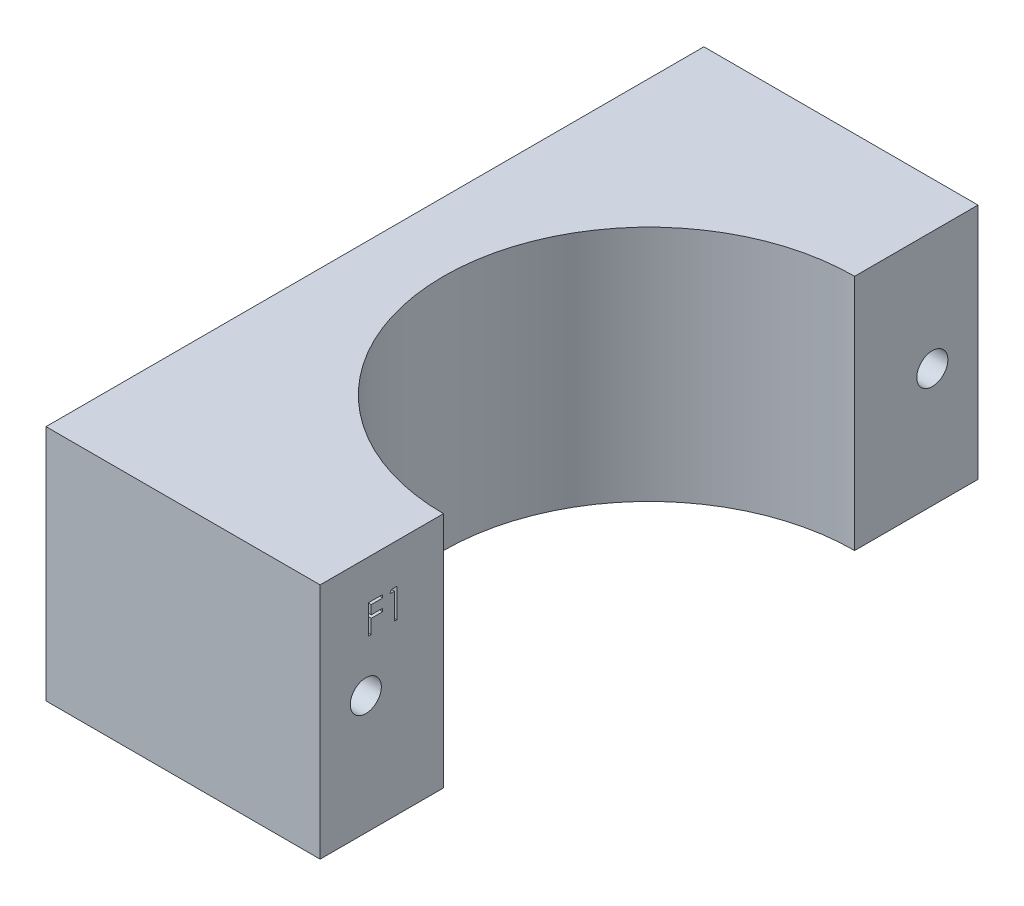
ISO-10303-21;
HEADER;
FILE_DESCRIPTION(('STEP AP214'),'2;1');
FILE_NAME('part.step','',(''),(''),'','','');
FILE_SCHEMA(('AUTOMOTIVE_DESIGN { 1 0 10303 214 1 1 1 1 }'));
ENDSEC;
DATA;
#1=APPLICATION_CONTEXT('core data for automotive mechanical design processes');
#2=APPLICATION_PROTOCOL_DEFINITION('international standard','automotive_design',2000,#1);
#3=PRODUCT_CONTEXT('',#1,'mechanical');
#4=PRODUCT('Part','Part','',(#3));
#5=PRODUCT_RELATED_PRODUCT_CATEGORY('part','',(#4));
#6=PRODUCT_DEFINITION_FORMATION('','',#4);
#7=PRODUCT_DEFINITION_CONTEXT('part definition',#1,'design');
#8=PRODUCT_DEFINITION('design','',#6,#7);
#9=PRODUCT_DEFINITION_SHAPE('','',#8);
#10=(LENGTH_UNIT() NAMED_UNIT(*) SI_UNIT(.MILLI.,.METRE.));
#11=(NAMED_UNIT(*) PLANE_ANGLE_UNIT() SI_UNIT($,.RADIAN.));
#12=(NAMED_UNIT(*) SI_UNIT($,.STERADIAN.) SOLID_ANGLE_UNIT());
#13=UNCERTAINTY_MEASURE_WITH_UNIT(LENGTH_MEASURE(1.E-05),#10,'distance_accuracy_value','');
#14=(GEOMETRIC_REPRESENTATION_CONTEXT(3) GLOBAL_UNCERTAINTY_ASSIGNED_CONTEXT((#13)) GLOBAL_UNIT_ASSIGNED_CONTEXT((#10,
#11,#12)) REPRESENTATION_CONTEXT('',''));
#15=CARTESIAN_POINT('',(0.,0.,0.));
#16=DIRECTION('',(0.,0.,1.));
#17=DIRECTION('',(1.,0.,0.));
#18=AXIS2_PLACEMENT_3D('',#15,#16,#17);
#19=CARTESIAN_POINT('',(-16.9982753010088,26.,39.4714285714286));
#20=DIRECTION('',(-1.,0.,0.));
#21=DIRECTION('',(0.,0.,1.));
#22=AXIS2_PLACEMENT_3D('',#19,#20,#21);
#23=PLANE('',#22);
#24=DIRECTION('',(0.,0.867930013859709,-0.496686511837683));
#25=VECTOR('',#24,1.);
#26=CARTESIAN_POINT('',(-16.9982753010088,21.3391684697392,31.844038870106));
#27=LINE('',#26,#25);
#28=CARTESIAN_POINT('',(-16.9982753010088,21.3391684697392,31.844038870106));
#29=VERTEX_POINT('',#28);
#30=CARTESIAN_POINT('',(-16.9982753010088,21.6648094953802,31.6576857050419));
#31=VERTEX_POINT('',#30);
#32=EDGE_CURVE('E67',#29,#31,#27,.T.);
#33=ORIENTED_EDGE('',*,*,#32,.T.);
#34=DIRECTION('',(0.,0.,-1.));
#35=VECTOR('',#34,1.);
#36=CARTESIAN_POINT('',(-16.9982753010088,21.6648094953802,31.6576857050419));
#37=LINE('',#36,#35);
#38=CARTESIAN_POINT('',(-16.9982753010088,21.6648094953802,31.0706414342085));
#39=VERTEX_POINT('',#38);
#40=EDGE_CURVE('E267',#31,#39,#37,.T.);
#41=ORIENTED_EDGE('',*,*,#40,.T.);
#42=DIRECTION('',(0.,-1.,0.));
#43=VECTOR('',#42,1.);
#44=CARTESIAN_POINT('',(-16.9982753010088,21.6648094953802,31.0706414342085));
#45=LINE('',#44,#43);
#46=CARTESIAN_POINT('',(-16.9982753010088,18.4898094953802,31.0706414342085));
#47=VERTEX_POINT('',#46);
#48=EDGE_CURVE('E263',#39,#47,#45,.T.);
#49=ORIENTED_EDGE('',*,*,#48,.T.);
#50=DIRECTION('',(0.,0.,1.));
#51=VECTOR('',#50,1.);
#52=CARTESIAN_POINT('',(-16.9982753010088,18.4898094953802,31.0706414342085));
#53=LINE('',#52,#51);
#54=CARTESIAN_POINT('',(-16.9982753010088,18.4898094953802,31.3555773316444));
#55=VERTEX_POINT('',#54);
#56=EDGE_CURVE('E259',#47,#55,#53,.T.);
#57=ORIENTED_EDGE('',*,*,#56,.T.);
#58=DIRECTION('',(0.,1.,0.));
#59=VECTOR('',#58,1.);
#60=CARTESIAN_POINT('',(-16.9982753010088,18.4898094953802,31.3555773316444));
#61=LINE('',#60,#59);
#62=CARTESIAN_POINT('',(-16.9982753010088,21.3391684697392,31.3555773316444));
#63=VERTEX_POINT('',#62);
#64=EDGE_CURVE('E254',#55,#63,#61,.T.);
#65=ORIENTED_EDGE('',*,*,#64,.T.);
#66=DIRECTION('',(0.,0.,1.));
#67=VECTOR('',#66,1.);
#68=CARTESIAN_POINT('',(-16.9982753010088,21.3391684697392,31.3555773316444));
#69=LINE('',#68,#67);
#70=EDGE_CURVE('E250',#63,#29,#69,.T.);
#71=ORIENTED_EDGE('',*,*,#70,.T.);
#72=EDGE_LOOP('',(#33,#41,#49,#57,#65,#71));
#73=FACE_BOUND('',#72,.T.);
#74=CARTESIAN_POINT('',(-16.9982753010088,13.,34.4714285714286));
#75=DIRECTION('',(1.,0.,0.));
#76=DIRECTION('',(0.,0.,-1.));
#77=AXIS2_PLACEMENT_3D('',#74,#75,#76);
#78=CIRCLE('',#77,1.7);
#79=CARTESIAN_POINT('',(-16.9982753010088,13.,32.7714285714286));
#80=VERTEX_POINT('',#79);
#81=EDGE_CURVE('E295',#80,#80,#78,.T.);
#82=ORIENTED_EDGE('',*,*,#81,.F.);
#83=EDGE_LOOP('',(#82));
#84=FACE_BOUND('',#83,.T.);
#85=DIRECTION('',(0.,0.,-1.));
#86=VECTOR('',#85,1.);
#87=CARTESIAN_POINT('',(-16.9982753010088,0.,39.4714285714286));
#88=LINE('',#87,#86);
#89=CARTESIAN_POINT('',(-16.9982753010088,0.,39.4714285714286));
#90=VERTEX_POINT('',#89);
#91=CARTESIAN_POINT('',(-16.9982753010088,0.,25.9714285714286));
#92=VERTEX_POINT('',#91);
#93=EDGE_CURVE('E332',#90,#92,#88,.T.);
#94=ORIENTED_EDGE('',*,*,#93,.T.);
#95=DIRECTION('',(0.,-1.,0.));
#96=VECTOR('',#95,1.);
#97=CARTESIAN_POINT('',(-16.9982753010088,26.,25.9714285714286));
#98=LINE('',#97,#96);
#99=CARTESIAN_POINT('',(-16.9982753010088,26.,25.9714285714286));
#100=VERTEX_POINT('',#99);
#101=EDGE_CURVE('E347',#100,#92,#98,.T.);
#102=ORIENTED_EDGE('',*,*,#101,.F.);
#103=DIRECTION('',(0.,0.,-1.));
#104=VECTOR('',#103,1.);
#105=CARTESIAN_POINT('',(-16.9982753010088,26.,39.4714285714286));
#106=LINE('',#105,#104);
#107=CARTESIAN_POINT('',(-16.9982753010088,26.,39.4714285714286));
#108=VERTEX_POINT('',#107);
#109=EDGE_CURVE('E313',#108,#100,#106,.T.);
#110=ORIENTED_EDGE('',*,*,#109,.F.);
#111=DIRECTION('',(0.,-1.,0.));
#112=VECTOR('',#111,1.);
#113=CARTESIAN_POINT('',(-16.9982753010088,26.,39.4714285714286));
#114=LINE('',#113,#112);
#115=EDGE_CURVE('E351',#108,#90,#114,.T.);
#116=ORIENTED_EDGE('',*,*,#115,.T.);
#117=EDGE_LOOP('',(#94,#102,#110,#116));
#118=FACE_BOUND('',#117,.T.);
#119=DIRECTION('',(0.,1.,0.));
#120=VECTOR('',#119,1.);
#121=CARTESIAN_POINT('',(-16.9982753010088,18.4898094953802,34.1642311777983));
#122=LINE('',#121,#120);
#123=CARTESIAN_POINT('',(-16.9982753010088,18.4898094953802,34.1642311777983));
#124=VERTEX_POINT('',#123);
#125=CARTESIAN_POINT('',(-16.9982753010088,21.6648094953802,34.1642311777983));
#126=VERTEX_POINT('',#125);
#127=EDGE_CURVE('E59',#124,#126,#122,.T.);
#128=ORIENTED_EDGE('',*,*,#127,.T.);
#129=DIRECTION('',(0.,0.,-1.));
#130=VECTOR('',#129,1.);
#131=CARTESIAN_POINT('',(-16.9982753010088,21.6648094953802,34.1642311777983));
#132=LINE('',#131,#130);
#133=CARTESIAN_POINT('',(-16.9982753010088,21.6648094953802,32.6174363060034));
#134=VERTEX_POINT('',#133);
#135=EDGE_CURVE('E217',#126,#134,#132,.T.);
#136=ORIENTED_EDGE('',*,*,#135,.T.);
#137=DIRECTION('',(0.,-1.,0.));
#138=VECTOR('',#137,1.);
#139=CARTESIAN_POINT('',(-16.9982753010088,21.6648094953802,32.6174363060034));
#140=LINE('',#139,#138);
#141=CARTESIAN_POINT('',(-16.9982753010088,21.3391684697392,32.6174363060034));
#142=VERTEX_POINT('',#141);
#143=EDGE_CURVE('E752',#134,#142,#140,.T.);
#144=ORIENTED_EDGE('',*,*,#143,.T.);
#145=DIRECTION('',(0.,0.,1.));
#146=VECTOR('',#145,1.);
#147=CARTESIAN_POINT('',(-16.9982753010088,21.3391684697392,32.6174363060034));
#148=LINE('',#147,#146);
#149=CARTESIAN_POINT('',(-16.9982753010088,21.3391684697392,33.8792952803624));
#150=VERTEX_POINT('',#149);
#151=EDGE_CURVE('E754',#142,#150,#148,.T.);
#152=ORIENTED_EDGE('',*,*,#151,.T.);
#153=DIRECTION('',(0.,-1.,0.));
#154=VECTOR('',#153,1.);
#155=CARTESIAN_POINT('',(-16.9982753010088,21.3391684697392,33.8792952803624));
#156=LINE('',#155,#154);
#157=CARTESIAN_POINT('',(-16.9982753010088,20.3622453928161,33.8792952803624));
#158=VERTEX_POINT('',#157);
#159=EDGE_CURVE('E759',#150,#158,#156,.T.);
#160=ORIENTED_EDGE('',*,*,#159,.T.);
#161=DIRECTION('',(0.,0.,-1.));
#162=VECTOR('',#161,1.);
#163=CARTESIAN_POINT('',(-16.9982753010088,20.3622453928161,33.8792952803624));
#164=LINE('',#163,#162);
#165=CARTESIAN_POINT('',(-16.9982753010088,20.3622453928161,32.6174363060034));
#166=VERTEX_POINT('',#165);
#167=EDGE_CURVE('E769',#158,#166,#164,.T.);
#168=ORIENTED_EDGE('',*,*,#167,.T.);
#169=DIRECTION('',(0.,-1.,0.));
#170=VECTOR('',#169,1.);
#171=CARTESIAN_POINT('',(-16.9982753010088,20.3622453928161,32.6174363060034));
#172=LINE('',#171,#170);
#173=CARTESIAN_POINT('',(-16.9982753010088,20.0366043671751,32.6174363060034));
#174=VERTEX_POINT('',#173);
#175=EDGE_CURVE('E724',#166,#174,#172,.T.);
#176=ORIENTED_EDGE('',*,*,#175,.T.);
#177=DIRECTION('',(0.,0.,1.));
#178=VECTOR('',#177,1.);
#179=CARTESIAN_POINT('',(-16.9982753010088,20.0366043671751,32.6174363060034));
#180=LINE('',#179,#178);
#181=CARTESIAN_POINT('',(-16.9982753010088,20.0366043671751,33.8792952803624));
#182=VERTEX_POINT('',#181);
#183=EDGE_CURVE('E719',#174,#182,#180,.T.);
#184=ORIENTED_EDGE('',*,*,#183,.T.);
#185=DIRECTION('',(0.,-1.,0.));
#186=VECTOR('',#185,1.);
#187=CARTESIAN_POINT('',(-16.9982753010088,20.0366043671751,33.8792952803624));
#188=LINE('',#187,#186);
#189=CARTESIAN_POINT('',(-16.9982753010088,18.4898094953802,33.8792952803624));
#190=VERTEX_POINT('',#189);
#191=EDGE_CURVE('E713',#182,#190,#188,.T.);
#192=ORIENTED_EDGE('',*,*,#191,.T.);
#193=DIRECTION('',(0.,0.,1.));
#194=VECTOR('',#193,1.);
#195=CARTESIAN_POINT('',(-16.9982753010088,18.4898094953802,33.8792952803624));
#196=LINE('',#195,#194);
#197=EDGE_CURVE('E213',#190,#124,#196,.T.);
#198=ORIENTED_EDGE('',*,*,#197,.T.);
#199=EDGE_LOOP('',(#128,#136,#144,#152,#160,#168,#176,#184,#192,#198));
#200=FACE_BOUND('',#199,.T.);
#201=ADVANCED_FACE('F43',(#73,#84,#118,#200),#23,.F.);
#202=CARTESIAN_POINT('',(-46.9982753010088,26.,-32.5285714285714));
#203=DIRECTION('',(0.,0.,1.));
#204=DIRECTION('',(1.,0.,0.));
#205=AXIS2_PLACEMENT_3D('',#202,#203,#204);
#206=PLANE('',#205);
#207=DIRECTION('',(-1.,0.,0.));
#208=VECTOR('',#207,1.);
#209=CARTESIAN_POINT('',(-46.9982753010088,0.,-32.5285714285714));
#210=LINE('',#209,#208);
#211=CARTESIAN_POINT('',(-16.9982753010088,0.,-32.5285714285714));
#212=VERTEX_POINT('',#211);
#213=CARTESIAN_POINT('',(-46.9982753010088,0.,-32.5285714285714));
#214=VERTEX_POINT('',#213);
#215=EDGE_CURVE('E294',#212,#214,#210,.T.);
#216=ORIENTED_EDGE('',*,*,#215,.T.);
#217=DIRECTION('',(0.,-1.,0.));
#218=VECTOR('',#217,1.);
#219=CARTESIAN_POINT('',(-46.9982753010088,26.,-32.5285714285714));
#220=LINE('',#219,#218);
#221=CARTESIAN_POINT('',(-46.9982753010088,26.,-32.5285714285714));
#222=VERTEX_POINT('',#221);
#223=EDGE_CURVE('E11',#222,#214,#220,.T.);
#224=ORIENTED_EDGE('',*,*,#223,.F.);
#225=DIRECTION('',(-1.,0.,0.));
#226=VECTOR('',#225,1.);
#227=CARTESIAN_POINT('',(-46.9982753010088,26.,-32.5285714285714));
#228=LINE('',#227,#226);
#229=CARTESIAN_POINT('',(-16.9982753010088,26.,-32.5285714285714));
#230=VERTEX_POINT('',#229);
#231=EDGE_CURVE('E302',#230,#222,#228,.T.);
#232=ORIENTED_EDGE('',*,*,#231,.F.);
#233=DIRECTION('',(0.,-1.,0.));
#234=VECTOR('',#233,1.);
#235=CARTESIAN_POINT('',(-16.9982753010088,26.,-32.5285714285714));
#236=LINE('',#235,#234);
#237=EDGE_CURVE('E322',#230,#212,#236,.T.);
#238=ORIENTED_EDGE('',*,*,#237,.T.);
#239=EDGE_LOOP('',(#216,#224,#232,#238));
#240=FACE_BOUND('',#239,.T.);
#241=ADVANCED_FACE('F45',(#240),#206,.F.);
#242=CARTESIAN_POINT('',(-46.9982753010088,26.,-32.5285714285714));
#243=DIRECTION('',(1.,0.,0.));
#244=DIRECTION('',(0.,0.,-1.));
#245=AXIS2_PLACEMENT_3D('',#242,#243,#244);
#246=PLANE('',#245);
#247=CARTESIAN_POINT('',(-46.9982753010088,13.,34.4714285714286));
#248=DIRECTION('',(1.,0.,0.));
#249=DIRECTION('',(0.,0.,-1.));
#250=AXIS2_PLACEMENT_3D('',#247,#248,#249);
#251=CIRCLE('',#250,1.7);
#252=CARTESIAN_POINT('',(-46.9982753010088,13.,32.7714285714286));
#253=VERTEX_POINT('',#252);
#254=EDGE_CURVE('E290',#253,#253,#251,.T.);
#255=ORIENTED_EDGE('',*,*,#254,.T.);
#256=EDGE_LOOP('',(#255));
#257=FACE_BOUND('',#256,.T.);
#258=CARTESIAN_POINT('',(-46.9982753010088,13.,-27.5285714285714));
#259=DIRECTION('',(1.,0.,0.));
#260=DIRECTION('',(0.,0.,-1.));
#261=AXIS2_PLACEMENT_3D('',#258,#259,#260);
#262=CIRCLE('',#261,1.7);
#263=CARTESIAN_POINT('',(-46.9982753010088,13.,-29.2285714285714));
#264=VERTEX_POINT('',#263);
#265=EDGE_CURVE('E219',#264,#264,#262,.T.);
#266=ORIENTED_EDGE('',*,*,#265,.T.);
#267=EDGE_LOOP('',(#266));
#268=FACE_BOUND('',#267,.T.);
#269=DIRECTION('',(0.,0.,1.));
#270=VECTOR('',#269,1.);
#271=CARTESIAN_POINT('',(-46.9982753010088,0.,-32.5285714285714));
#272=LINE('',#271,#270);
#273=CARTESIAN_POINT('',(-46.9982753010088,0.,39.4714285714286));
#274=VERTEX_POINT('',#273);
#275=EDGE_CURVE('E326',#214,#274,#272,.T.);
#276=ORIENTED_EDGE('',*,*,#275,.T.);
#277=DIRECTION('',(0.,-1.,0.));
#278=VECTOR('',#277,1.);
#279=CARTESIAN_POINT('',(-46.9982753010088,26.,39.4714285714286));
#280=LINE('',#279,#278);
#281=CARTESIAN_POINT('',(-46.9982753010088,26.,39.4714285714286));
#282=VERTEX_POINT('',#281);
#283=EDGE_CURVE('E52',#282,#274,#280,.T.);
#284=ORIENTED_EDGE('',*,*,#283,.F.);
#285=DIRECTION('',(0.,0.,1.));
#286=VECTOR('',#285,1.);
#287=CARTESIAN_POINT('',(-46.9982753010088,26.,-32.5285714285714));
#288=LINE('',#287,#286);
#289=EDGE_CURVE('E306',#222,#282,#288,.T.);
#290=ORIENTED_EDGE('',*,*,#289,.F.);
#291=ORIENTED_EDGE('',*,*,#223,.T.);
#292=EDGE_LOOP('',(#276,#284,#290,#291));
#293=FACE_BOUND('',#292,.T.);
#294=ADVANCED_FACE('F383',(#257,#268,#293),#246,.F.);
#295=CARTESIAN_POINT('',(-46.9982753010088,26.,39.4714285714286));
#296=DIRECTION('',(0.,0.,-1.));
#297=DIRECTION('',(-1.,0.,0.));
#298=AXIS2_PLACEMENT_3D('',#295,#296,#297);
#299=PLANE('',#298);
#300=DIRECTION('',(1.,0.,0.));
#301=VECTOR('',#300,1.);
#302=CARTESIAN_POINT('',(-46.9982753010088,0.,39.4714285714286));
#303=LINE('',#302,#301);
#304=EDGE_CURVE('E329',#274,#90,#303,.T.);
#305=ORIENTED_EDGE('',*,*,#304,.T.);
#306=ORIENTED_EDGE('',*,*,#115,.F.);
#307=DIRECTION('',(1.,0.,0.));
#308=VECTOR('',#307,1.);
#309=CARTESIAN_POINT('',(-46.9982753010088,26.,39.4714285714286));
#310=LINE('',#309,#308);
#311=EDGE_CURVE('E310',#282,#108,#310,.T.);
#312=ORIENTED_EDGE('',*,*,#311,.F.);
#313=ORIENTED_EDGE('',*,*,#283,.T.);
#314=EDGE_LOOP('',(#305,#306,#312,#313));
#315=FACE_BOUND('',#314,.T.);
#316=ADVANCED_FACE('F360',(#315),#299,.F.);
#317=CARTESIAN_POINT('',(-16.9982753010088,26.,3.47142857142857));
#318=DIRECTION('',(0.,-1.,0.));
#319=DIRECTION('',(0.,0.,-1.));
#320=AXIS2_PLACEMENT_3D('',#317,#318,#319);
#321=CYLINDRICAL_SURFACE('',#320,22.5);
#322=CARTESIAN_POINT('',(-16.9982753010088,0.,3.47142857142857));
#323=DIRECTION('',(0.,-1.,0.));
#324=DIRECTION('',(0.,0.,1.));
#325=AXIS2_PLACEMENT_3D('',#322,#323,#324);
#326=CIRCLE('',#325,22.5);
#327=CARTESIAN_POINT('',(-16.9982753010088,0.,-19.0285714285714));
#328=VERTEX_POINT('',#327);
#329=EDGE_CURVE('E335',#92,#328,#326,.T.);
#330=ORIENTED_EDGE('',*,*,#329,.T.);
#331=DIRECTION('',(0.,-1.,0.));
#332=VECTOR('',#331,1.);
#333=CARTESIAN_POINT('',(-16.9982753010088,26.,-19.0285714285714));
#334=LINE('',#333,#332);
#335=CARTESIAN_POINT('',(-16.9982753010088,26.,-19.0285714285714));
#336=VERTEX_POINT('',#335);
#337=EDGE_CURVE('E343',#336,#328,#334,.T.);
#338=ORIENTED_EDGE('',*,*,#337,.F.);
#339=CARTESIAN_POINT('',(-16.9982753010088,26.,3.47142857142857));
#340=DIRECTION('',(0.,-1.,0.));
#341=DIRECTION('',(0.,0.,1.));
#342=AXIS2_PLACEMENT_3D('',#339,#340,#341);
#343=CIRCLE('',#342,22.5);
#344=EDGE_CURVE('E316',#100,#336,#343,.T.);
#345=ORIENTED_EDGE('',*,*,#344,.F.);
#346=ORIENTED_EDGE('',*,*,#101,.T.);
#347=EDGE_LOOP('',(#330,#338,#345,#346));
#348=FACE_BOUND('',#347,.T.);
#349=ADVANCED_FACE('F375',(#348),#321,.F.);
#350=CARTESIAN_POINT('',(-16.9982753010088,26.,-32.5285714285714));
#351=DIRECTION('',(-1.,0.,0.));
#352=DIRECTION('',(0.,0.,1.));
#353=AXIS2_PLACEMENT_3D('',#350,#351,#352);
#354=PLANE('',#353);
#355=CARTESIAN_POINT('',(-16.9982753010088,13.,-27.5285714285714));
#356=DIRECTION('',(1.,0.,0.));
#357=DIRECTION('',(0.,0.,-1.));
#358=AXIS2_PLACEMENT_3D('',#355,#356,#357);
#359=CIRCLE('',#358,1.7);
#360=CARTESIAN_POINT('',(-16.9982753010088,13.,-29.2285714285714));
#361=VERTEX_POINT('',#360);
#362=EDGE_CURVE('E225',#361,#361,#359,.T.);
#363=ORIENTED_EDGE('',*,*,#362,.F.);
#364=EDGE_LOOP('',(#363));
#365=FACE_BOUND('',#364,.T.);
#366=DIRECTION('',(0.,0.,-1.));
#367=VECTOR('',#366,1.);
#368=CARTESIAN_POINT('',(-16.9982753010088,0.,-32.5285714285714));
#369=LINE('',#368,#367);
#370=EDGE_CURVE('E307',#328,#212,#369,.T.);
#371=ORIENTED_EDGE('',*,*,#370,.T.);
#372=ORIENTED_EDGE('',*,*,#237,.F.);
#373=DIRECTION('',(0.,0.,-1.));
#374=VECTOR('',#373,1.);
#375=CARTESIAN_POINT('',(-16.9982753010088,26.,-32.5285714285714));
#376=LINE('',#375,#374);
#377=EDGE_CURVE('E319',#336,#230,#376,.T.);
#378=ORIENTED_EDGE('',*,*,#377,.F.);
#379=ORIENTED_EDGE('',*,*,#337,.T.);
#380=EDGE_LOOP('',(#371,#372,#378,#379));
#381=FACE_BOUND('',#380,.T.);
#382=ADVANCED_FACE('F386',(#365,#381),#354,.F.);
#383=CARTESIAN_POINT('',(-16.9982753010088,26.,3.47142857142857));
#384=DIRECTION('',(0.,1.,0.));
#385=DIRECTION('',(0.,0.,1.));
#386=AXIS2_PLACEMENT_3D('',#383,#384,#385);
#387=PLANE('',#386);
#388=ORIENTED_EDGE('',*,*,#231,.T.);
#389=ORIENTED_EDGE('',*,*,#289,.T.);
#390=ORIENTED_EDGE('',*,*,#311,.T.);
#391=ORIENTED_EDGE('',*,*,#109,.T.);
#392=ORIENTED_EDGE('',*,*,#344,.T.);
#393=ORIENTED_EDGE('',*,*,#377,.T.);
#394=EDGE_LOOP('',(#388,#389,#390,#391,#392,#393));
#395=FACE_BOUND('',#394,.T.);
#396=ADVANCED_FACE('F379',(#395),#387,.T.);
#397=CARTESIAN_POINT('',(-16.9982753010088,0.,3.47142857142857));
#398=DIRECTION('',(0.,1.,0.));
#399=DIRECTION('',(0.,0.,1.));
#400=AXIS2_PLACEMENT_3D('',#397,#398,#399);
#401=PLANE('',#400);
#402=ORIENTED_EDGE('',*,*,#215,.F.);
#403=ORIENTED_EDGE('',*,*,#370,.F.);
#404=ORIENTED_EDGE('',*,*,#329,.F.);
#405=ORIENTED_EDGE('',*,*,#93,.F.);
#406=ORIENTED_EDGE('',*,*,#304,.F.);
#407=ORIENTED_EDGE('',*,*,#275,.F.);
#408=EDGE_LOOP('',(#402,#403,#404,#405,#406,#407));
#409=FACE_BOUND('',#408,.T.);
#410=ADVANCED_FACE('F366',(#409),#401,.F.);
#411=CARTESIAN_POINT('',(-46.9982753010088,13.,-27.5285714285714));
#412=DIRECTION('',(1.,0.,0.));
#413=DIRECTION('',(0.,0.,-1.));
#414=AXIS2_PLACEMENT_3D('',#411,#412,#413);
#415=CYLINDRICAL_SURFACE('',#414,1.7);
#416=ORIENTED_EDGE('',*,*,#265,.F.);
#417=EDGE_LOOP('',(#416));
#418=FACE_BOUND('',#417,.T.);
#419=ORIENTED_EDGE('',*,*,#362,.T.);
#420=EDGE_LOOP('',(#419));
#421=FACE_BOUND('',#420,.T.);
#422=ADVANCED_FACE('F415',(#418,#421),#415,.F.);
#423=CARTESIAN_POINT('',(-46.9982753010088,13.,34.4714285714286));
#424=DIRECTION('',(1.,0.,0.));
#425=DIRECTION('',(0.,0.,-1.));
#426=AXIS2_PLACEMENT_3D('',#423,#424,#425);
#427=CYLINDRICAL_SURFACE('',#426,1.7);
#428=ORIENTED_EDGE('',*,*,#254,.F.);
#429=EDGE_LOOP('',(#428));
#430=FACE_BOUND('',#429,.T.);
#431=ORIENTED_EDGE('',*,*,#81,.T.);
#432=EDGE_LOOP('',(#431));
#433=FACE_BOUND('',#432,.T.);
#434=ADVANCED_FACE('F418',(#430,#433),#427,.F.);
#435=CARTESIAN_POINT('',(-17.9982753010088,21.3391684697392,31.844038870106));
#436=DIRECTION('',(0.,-0.496686511837683,-0.86793001385971));
#437=DIRECTION('',(0.,0.86793001385971,-0.496686511837683));
#438=AXIS2_PLACEMENT_3D('',#435,#436,#437);
#439=PLANE('',#438);
#440=ORIENTED_EDGE('',*,*,#32,.F.);
#441=DIRECTION('',(1.,0.,0.));
#442=VECTOR('',#441,1.);
#443=CARTESIAN_POINT('',(-17.9982753010088,21.3391684697392,31.844038870106));
#444=LINE('',#443,#442);
#445=CARTESIAN_POINT('',(-17.9982753010088,21.3391684697392,31.844038870106));
#446=VERTEX_POINT('',#445);
#447=EDGE_CURVE('E246',#446,#29,#444,.T.);
#448=ORIENTED_EDGE('',*,*,#447,.F.);
#449=DIRECTION('',(0.,0.867930013859709,-0.496686511837683));
#450=VECTOR('',#449,1.);
#451=CARTESIAN_POINT('',(-17.9982753010088,21.3391684697392,31.844038870106));
#452=LINE('',#451,#450);
#453=CARTESIAN_POINT('',(-17.9982753010088,21.6648094953802,31.6576857050419));
#454=VERTEX_POINT('',#453);
#455=EDGE_CURVE('E255',#446,#454,#452,.T.);
#456=ORIENTED_EDGE('',*,*,#455,.T.);
#457=DIRECTION('',(1.,0.,0.));
#458=VECTOR('',#457,1.);
#459=CARTESIAN_POINT('',(-17.9982753010088,21.6648094953802,31.6576857050419));
#460=LINE('',#459,#458);
#461=EDGE_CURVE('E231',#454,#31,#460,.T.);
#462=ORIENTED_EDGE('',*,*,#461,.T.);
#463=EDGE_LOOP('',(#440,#448,#456,#462));
#464=FACE_BOUND('',#463,.T.);
#465=ADVANCED_FACE('F424',(#464),#439,.T.);
#466=CARTESIAN_POINT('',(-17.9982753010088,21.6648094953802,31.6576857050419));
#467=DIRECTION('',(0.,-1.,0.));
#468=DIRECTION('',(0.,0.,-1.));
#469=AXIS2_PLACEMENT_3D('',#466,#467,#468);
#470=PLANE('',#469);
#471=ORIENTED_EDGE('',*,*,#40,.F.);
#472=ORIENTED_EDGE('',*,*,#461,.F.);
#473=DIRECTION('',(0.,0.,-1.));
#474=VECTOR('',#473,1.);
#475=CARTESIAN_POINT('',(-17.9982753010088,21.6648094953802,31.6576857050419));
#476=LINE('',#475,#474);
#477=CARTESIAN_POINT('',(-17.9982753010088,21.6648094953802,31.0706414342085));
#478=VERTEX_POINT('',#477);
#479=EDGE_CURVE('E284',#454,#478,#476,.T.);
#480=ORIENTED_EDGE('',*,*,#479,.T.);
#481=DIRECTION('',(1.,0.,0.));
#482=VECTOR('',#481,1.);
#483=CARTESIAN_POINT('',(-17.9982753010088,21.6648094953802,31.0706414342085));
#484=LINE('',#483,#482);
#485=EDGE_CURVE('E234',#478,#39,#484,.T.);
#486=ORIENTED_EDGE('',*,*,#485,.T.);
#487=EDGE_LOOP('',(#471,#472,#480,#486));
#488=FACE_BOUND('',#487,.T.);
#489=ADVANCED_FACE('F447',(#488),#470,.T.);
#490=CARTESIAN_POINT('',(-17.9982753010088,21.6648094953802,31.0706414342085));
#491=DIRECTION('',(0.,0.,1.));
#492=DIRECTION('',(1.,0.,0.));
#493=AXIS2_PLACEMENT_3D('',#490,#491,#492);
#494=PLANE('',#493);
#495=ORIENTED_EDGE('',*,*,#48,.F.);
#496=ORIENTED_EDGE('',*,*,#485,.F.);
#497=DIRECTION('',(0.,-1.,0.));
#498=VECTOR('',#497,1.);
#499=CARTESIAN_POINT('',(-17.9982753010088,21.6648094953802,31.0706414342085));
#500=LINE('',#499,#498);
#501=CARTESIAN_POINT('',(-17.9982753010088,18.4898094953802,31.0706414342085));
#502=VERTEX_POINT('',#501);
#503=EDGE_CURVE('E281',#478,#502,#500,.T.);
#504=ORIENTED_EDGE('',*,*,#503,.T.);
#505=DIRECTION('',(1.,0.,0.));
#506=VECTOR('',#505,1.);
#507=CARTESIAN_POINT('',(-17.9982753010088,18.4898094953802,31.0706414342085));
#508=LINE('',#507,#506);
#509=EDGE_CURVE('E237',#502,#47,#508,.T.);
#510=ORIENTED_EDGE('',*,*,#509,.T.);
#511=EDGE_LOOP('',(#495,#496,#504,#510));
#512=FACE_BOUND('',#511,.T.);
#513=ADVANCED_FACE('F443',(#512),#494,.T.);
#514=CARTESIAN_POINT('',(-17.9982753010088,18.4898094953802,31.0706414342085));
#515=DIRECTION('',(0.,1.,0.));
#516=DIRECTION('',(0.,0.,1.));
#517=AXIS2_PLACEMENT_3D('',#514,#515,#516);
#518=PLANE('',#517);
#519=ORIENTED_EDGE('',*,*,#56,.F.);
#520=ORIENTED_EDGE('',*,*,#509,.F.);
#521=DIRECTION('',(0.,0.,1.));
#522=VECTOR('',#521,1.);
#523=CARTESIAN_POINT('',(-17.9982753010088,18.4898094953802,31.0706414342085));
#524=LINE('',#523,#522);
#525=CARTESIAN_POINT('',(-17.9982753010088,18.4898094953802,31.3555773316444));
#526=VERTEX_POINT('',#525);
#527=EDGE_CURVE('E278',#502,#526,#524,.T.);
#528=ORIENTED_EDGE('',*,*,#527,.T.);
#529=DIRECTION('',(1.,0.,0.));
#530=VECTOR('',#529,1.);
#531=CARTESIAN_POINT('',(-17.9982753010088,18.4898094953802,31.3555773316444));
#532=LINE('',#531,#530);
#533=EDGE_CURVE('E240',#526,#55,#532,.T.);
#534=ORIENTED_EDGE('',*,*,#533,.T.);
#535=EDGE_LOOP('',(#519,#520,#528,#534));
#536=FACE_BOUND('',#535,.T.);
#537=ADVANCED_FACE('F439',(#536),#518,.T.);
#538=CARTESIAN_POINT('',(-17.9982753010088,18.4898094953802,31.3555773316444));
#539=DIRECTION('',(0.,0.,-1.));
#540=DIRECTION('',(-1.,0.,0.));
#541=AXIS2_PLACEMENT_3D('',#538,#539,#540);
#542=PLANE('',#541);
#543=ORIENTED_EDGE('',*,*,#64,.F.);
#544=ORIENTED_EDGE('',*,*,#533,.F.);
#545=DIRECTION('',(0.,1.,0.));
#546=VECTOR('',#545,1.);
#547=CARTESIAN_POINT('',(-17.9982753010088,18.4898094953802,31.3555773316444));
#548=LINE('',#547,#546);
#549=CARTESIAN_POINT('',(-17.9982753010088,21.3391684697392,31.3555773316444));
#550=VERTEX_POINT('',#549);
#551=EDGE_CURVE('E275',#526,#550,#548,.T.);
#552=ORIENTED_EDGE('',*,*,#551,.T.);
#553=DIRECTION('',(1.,0.,0.));
#554=VECTOR('',#553,1.);
#555=CARTESIAN_POINT('',(-17.9982753010088,21.3391684697392,31.3555773316444));
#556=LINE('',#555,#554);
#557=EDGE_CURVE('E243',#550,#63,#556,.T.);
#558=ORIENTED_EDGE('',*,*,#557,.T.);
#559=EDGE_LOOP('',(#543,#544,#552,#558));
#560=FACE_BOUND('',#559,.T.);
#561=ADVANCED_FACE('F435',(#560),#542,.T.);
#562=CARTESIAN_POINT('',(-17.9982753010088,21.3391684697392,31.3555773316444));
#563=DIRECTION('',(0.,1.,0.));
#564=DIRECTION('',(0.,0.,1.));
#565=AXIS2_PLACEMENT_3D('',#562,#563,#564);
#566=PLANE('',#565);
#567=ORIENTED_EDGE('',*,*,#70,.F.);
#568=ORIENTED_EDGE('',*,*,#557,.F.);
#569=DIRECTION('',(0.,0.,1.));
#570=VECTOR('',#569,1.);
#571=CARTESIAN_POINT('',(-17.9982753010088,21.3391684697392,31.3555773316444));
#572=LINE('',#571,#570);
#573=EDGE_CURVE('E249',#550,#446,#572,.T.);
#574=ORIENTED_EDGE('',*,*,#573,.T.);
#575=ORIENTED_EDGE('',*,*,#447,.T.);
#576=EDGE_LOOP('',(#567,#568,#574,#575));
#577=FACE_BOUND('',#576,.T.);
#578=ADVANCED_FACE('F431',(#577),#566,.T.);
#579=CARTESIAN_POINT('',(-17.9982753010088,0.,0.));
#580=DIRECTION('',(-1.,0.,0.));
#581=DIRECTION('',(0.,0.,1.));
#582=AXIS2_PLACEMENT_3D('',#579,#580,#581);
#583=PLANE('',#582);
#584=ORIENTED_EDGE('',*,*,#455,.F.);
#585=ORIENTED_EDGE('',*,*,#573,.F.);
#586=ORIENTED_EDGE('',*,*,#551,.F.);
#587=ORIENTED_EDGE('',*,*,#527,.F.);
#588=ORIENTED_EDGE('',*,*,#503,.F.);
#589=ORIENTED_EDGE('',*,*,#479,.F.);
#590=EDGE_LOOP('',(#584,#585,#586,#587,#588,#589));
#591=FACE_BOUND('',#590,.T.);
#592=ADVANCED_FACE('F428',(#591),#583,.F.);
#593=CARTESIAN_POINT('',(-17.9982753010088,18.4898094953802,34.1642311777983));
#594=DIRECTION('',(0.,0.,-1.));
#595=DIRECTION('',(-1.,0.,0.));
#596=AXIS2_PLACEMENT_3D('',#593,#594,#595);
#597=PLANE('',#596);
#598=ORIENTED_EDGE('',*,*,#127,.F.);
#599=DIRECTION('',(1.,0.,0.));
#600=VECTOR('',#599,1.);
#601=CARTESIAN_POINT('',(-17.9982753010088,18.4898094953802,34.1642311777983));
#602=LINE('',#601,#600);
#603=CARTESIAN_POINT('',(-17.9982753010088,18.4898094953802,34.1642311777983));
#604=VERTEX_POINT('',#603);
#605=EDGE_CURVE('E211',#604,#124,#602,.T.);
#606=ORIENTED_EDGE('',*,*,#605,.F.);
#607=DIRECTION('',(0.,1.,0.));
#608=VECTOR('',#607,1.);
#609=CARTESIAN_POINT('',(-17.9982753010088,18.4898094953802,34.1642311777983));
#610=LINE('',#609,#608);
#611=CARTESIAN_POINT('',(-17.9982753010088,21.6648094953802,34.1642311777983));
#612=VERTEX_POINT('',#611);
#613=EDGE_CURVE('E201',#604,#612,#610,.T.);
#614=ORIENTED_EDGE('',*,*,#613,.T.);
#615=DIRECTION('',(1.,0.,0.));
#616=VECTOR('',#615,1.);
#617=CARTESIAN_POINT('',(-17.9982753010088,21.6648094953802,34.1642311777983));
#618=LINE('',#617,#616);
#619=EDGE_CURVE('E210',#612,#126,#618,.T.);
#620=ORIENTED_EDGE('',*,*,#619,.T.);
#621=EDGE_LOOP('',(#598,#606,#614,#620));
#622=FACE_BOUND('',#621,.T.);
#623=ADVANCED_FACE('F209',(#622),#597,.T.);
#624=CARTESIAN_POINT('',(-17.9982753010088,21.6648094953802,34.1642311777983));
#625=DIRECTION('',(0.,-1.,0.));
#626=DIRECTION('',(0.,0.,-1.));
#627=AXIS2_PLACEMENT_3D('',#624,#625,#626);
#628=PLANE('',#627);
#629=ORIENTED_EDGE('',*,*,#135,.F.);
#630=ORIENTED_EDGE('',*,*,#619,.F.);
#631=DIRECTION('',(0.,0.,-1.));
#632=VECTOR('',#631,1.);
#633=CARTESIAN_POINT('',(-17.9982753010088,21.6648094953802,34.1642311777983));
#634=LINE('',#633,#632);
#635=CARTESIAN_POINT('',(-17.9982753010088,21.6648094953802,32.6174363060034));
#636=VERTEX_POINT('',#635);
#637=EDGE_CURVE('E197',#612,#636,#634,.T.);
#638=ORIENTED_EDGE('',*,*,#637,.T.);
#639=DIRECTION('',(1.,0.,0.));
#640=VECTOR('',#639,1.);
#641=CARTESIAN_POINT('',(-17.9982753010088,21.6648094953802,32.6174363060034));
#642=LINE('',#641,#640);
#643=EDGE_CURVE('E220',#636,#134,#642,.T.);
#644=ORIENTED_EDGE('',*,*,#643,.T.);
#645=EDGE_LOOP('',(#629,#630,#638,#644));
#646=FACE_BOUND('',#645,.T.);
#647=ADVANCED_FACE('F215',(#646),#628,.T.);
#648=CARTESIAN_POINT('',(-17.9982753010088,21.6648094953802,32.6174363060034));
#649=DIRECTION('',(0.,0.,1.));
#650=DIRECTION('',(1.,0.,0.));
#651=AXIS2_PLACEMENT_3D('',#648,#649,#650);
#652=PLANE('',#651);
#653=ORIENTED_EDGE('',*,*,#143,.F.);
#654=ORIENTED_EDGE('',*,*,#643,.F.);
#655=DIRECTION('',(0.,-1.,0.));
#656=VECTOR('',#655,1.);
#657=CARTESIAN_POINT('',(-17.9982753010088,21.6648094953802,32.6174363060034));
#658=LINE('',#657,#656);
#659=CARTESIAN_POINT('',(-17.9982753010088,21.3391684697392,32.6174363060034));
#660=VERTEX_POINT('',#659);
#661=EDGE_CURVE('E203',#636,#660,#658,.T.);
#662=ORIENTED_EDGE('',*,*,#661,.T.);
#663=DIRECTION('',(1.,0.,0.));
#664=VECTOR('',#663,1.);
#665=CARTESIAN_POINT('',(-17.9982753010088,21.3391684697392,32.6174363060034));
#666=LINE('',#665,#664);
#667=EDGE_CURVE('E227',#660,#142,#666,.T.);
#668=ORIENTED_EDGE('',*,*,#667,.T.);
#669=EDGE_LOOP('',(#653,#654,#662,#668));
#670=FACE_BOUND('',#669,.T.);
#671=ADVANCED_FACE('F458',(#670),#652,.T.);
#672=CARTESIAN_POINT('',(-17.9982753010088,21.3391684697392,32.6174363060034));
#673=DIRECTION('',(0.,1.,0.));
#674=DIRECTION('',(0.,0.,1.));
#675=AXIS2_PLACEMENT_3D('',#672,#673,#674);
#676=PLANE('',#675);
#677=ORIENTED_EDGE('',*,*,#151,.F.);
#678=ORIENTED_EDGE('',*,*,#667,.F.);
#679=DIRECTION('',(0.,0.,1.));
#680=VECTOR('',#679,1.);
#681=CARTESIAN_POINT('',(-17.9982753010088,21.3391684697392,32.6174363060034));
#682=LINE('',#681,#680);
#683=CARTESIAN_POINT('',(-17.9982753010088,21.3391684697392,33.8792952803624));
#684=VERTEX_POINT('',#683);
#685=EDGE_CURVE('E799',#660,#684,#682,.T.);
#686=ORIENTED_EDGE('',*,*,#685,.T.);
#687=DIRECTION('',(1.,0.,0.));
#688=VECTOR('',#687,1.);
#689=CARTESIAN_POINT('',(-17.9982753010088,21.3391684697392,33.8792952803624));
#690=LINE('',#689,#688);
#691=EDGE_CURVE('E745',#684,#150,#690,.T.);
#692=ORIENTED_EDGE('',*,*,#691,.T.);
#693=EDGE_LOOP('',(#677,#678,#686,#692));
#694=FACE_BOUND('',#693,.T.);
#695=ADVANCED_FACE('F461',(#694),#676,.T.);
#696=CARTESIAN_POINT('',(-17.9982753010088,21.3391684697392,33.8792952803624));
#697=DIRECTION('',(0.,0.,1.));
#698=DIRECTION('',(1.,0.,0.));
#699=AXIS2_PLACEMENT_3D('',#696,#697,#698);
#700=PLANE('',#699);
#701=ORIENTED_EDGE('',*,*,#159,.F.);
#702=ORIENTED_EDGE('',*,*,#691,.F.);
#703=DIRECTION('',(0.,-1.,0.));
#704=VECTOR('',#703,1.);
#705=CARTESIAN_POINT('',(-17.9982753010088,21.3391684697392,33.8792952803624));
#706=LINE('',#705,#704);
#707=CARTESIAN_POINT('',(-17.9982753010088,20.3622453928161,33.8792952803624));
#708=VERTEX_POINT('',#707);
#709=EDGE_CURVE('E796',#684,#708,#706,.T.);
#710=ORIENTED_EDGE('',*,*,#709,.T.);
#711=DIRECTION('',(1.,0.,0.));
#712=VECTOR('',#711,1.);
#713=CARTESIAN_POINT('',(-17.9982753010088,20.3622453928161,33.8792952803624));
#714=LINE('',#713,#712);
#715=EDGE_CURVE('E742',#708,#158,#714,.T.);
#716=ORIENTED_EDGE('',*,*,#715,.T.);
#717=EDGE_LOOP('',(#701,#702,#710,#716));
#718=FACE_BOUND('',#717,.T.);
#719=ADVANCED_FACE('F465',(#718),#700,.T.);
#720=CARTESIAN_POINT('',(-17.9982753010088,20.3622453928161,33.8792952803624));
#721=DIRECTION('',(0.,-1.,0.));
#722=DIRECTION('',(0.,0.,-1.));
#723=AXIS2_PLACEMENT_3D('',#720,#721,#722);
#724=PLANE('',#723);
#725=ORIENTED_EDGE('',*,*,#167,.F.);
#726=ORIENTED_EDGE('',*,*,#715,.F.);
#727=DIRECTION('',(0.,0.,-1.));
#728=VECTOR('',#727,1.);
#729=CARTESIAN_POINT('',(-17.9982753010088,20.3622453928161,33.8792952803624));
#730=LINE('',#729,#728);
#731=CARTESIAN_POINT('',(-17.9982753010088,20.3622453928161,32.6174363060034));
#732=VERTEX_POINT('',#731);
#733=EDGE_CURVE('E793',#708,#732,#730,.T.);
#734=ORIENTED_EDGE('',*,*,#733,.T.);
#735=DIRECTION('',(1.,0.,0.));
#736=VECTOR('',#735,1.);
#737=CARTESIAN_POINT('',(-17.9982753010088,20.3622453928161,32.6174363060034));
#738=LINE('',#737,#736);
#739=EDGE_CURVE('E739',#732,#166,#738,.T.);
#740=ORIENTED_EDGE('',*,*,#739,.T.);
#741=EDGE_LOOP('',(#725,#726,#734,#740));
#742=FACE_BOUND('',#741,.T.);
#743=ADVANCED_FACE('F469',(#742),#724,.T.);
#744=CARTESIAN_POINT('',(-17.9982753010088,20.3622453928161,32.6174363060034));
#745=DIRECTION('',(0.,0.,1.));
#746=DIRECTION('',(1.,0.,0.));
#747=AXIS2_PLACEMENT_3D('',#744,#745,#746);
#748=PLANE('',#747);
#749=ORIENTED_EDGE('',*,*,#175,.F.);
#750=ORIENTED_EDGE('',*,*,#739,.F.);
#751=DIRECTION('',(0.,-1.,0.));
#752=VECTOR('',#751,1.);
#753=CARTESIAN_POINT('',(-17.9982753010088,20.3622453928161,32.6174363060034));
#754=LINE('',#753,#752);
#755=CARTESIAN_POINT('',(-17.9982753010088,20.0366043671751,32.6174363060034));
#756=VERTEX_POINT('',#755);
#757=EDGE_CURVE('E778',#732,#756,#754,.T.);
#758=ORIENTED_EDGE('',*,*,#757,.T.);
#759=DIRECTION('',(1.,0.,0.));
#760=VECTOR('',#759,1.);
#761=CARTESIAN_POINT('',(-17.9982753010088,20.0366043671751,32.6174363060034));
#762=LINE('',#761,#760);
#763=EDGE_CURVE('E736',#756,#174,#762,.T.);
#764=ORIENTED_EDGE('',*,*,#763,.T.);
#765=EDGE_LOOP('',(#749,#750,#758,#764));
#766=FACE_BOUND('',#765,.T.);
#767=ADVANCED_FACE('F473',(#766),#748,.T.);
#768=CARTESIAN_POINT('',(-17.9982753010088,20.0366043671751,32.6174363060034));
#769=DIRECTION('',(0.,1.,0.));
#770=DIRECTION('',(0.,0.,1.));
#771=AXIS2_PLACEMENT_3D('',#768,#769,#770);
#772=PLANE('',#771);
#773=ORIENTED_EDGE('',*,*,#183,.F.);
#774=ORIENTED_EDGE('',*,*,#763,.F.);
#775=DIRECTION('',(0.,0.,1.));
#776=VECTOR('',#775,1.);
#777=CARTESIAN_POINT('',(-17.9982753010088,20.0366043671751,32.6174363060034));
#778=LINE('',#777,#776);
#779=CARTESIAN_POINT('',(-17.9982753010088,20.0366043671751,33.8792952803624));
#780=VERTEX_POINT('',#779);
#781=EDGE_CURVE('E780',#756,#780,#778,.T.);
#782=ORIENTED_EDGE('',*,*,#781,.T.);
#783=DIRECTION('',(1.,0.,0.));
#784=VECTOR('',#783,1.);
#785=CARTESIAN_POINT('',(-17.9982753010088,20.0366043671751,33.8792952803624));
#786=LINE('',#785,#784);
#787=EDGE_CURVE('E733',#780,#182,#786,.T.);
#788=ORIENTED_EDGE('',*,*,#787,.T.);
#789=EDGE_LOOP('',(#773,#774,#782,#788));
#790=FACE_BOUND('',#789,.T.);
#791=ADVANCED_FACE('F477',(#790),#772,.T.);
#792=CARTESIAN_POINT('',(-17.9982753010088,20.0366043671751,33.8792952803624));
#793=DIRECTION('',(0.,0.,1.));
#794=DIRECTION('',(1.,0.,0.));
#795=AXIS2_PLACEMENT_3D('',#792,#793,#794);
#796=PLANE('',#795);
#797=ORIENTED_EDGE('',*,*,#191,.F.);
#798=ORIENTED_EDGE('',*,*,#787,.F.);
#799=DIRECTION('',(0.,-1.,0.));
#800=VECTOR('',#799,1.);
#801=CARTESIAN_POINT('',(-17.9982753010088,20.0366043671751,33.8792952803624));
#802=LINE('',#801,#800);
#803=CARTESIAN_POINT('',(-17.9982753010088,18.4898094953802,33.8792952803624));
#804=VERTEX_POINT('',#803);
#805=EDGE_CURVE('E782',#780,#804,#802,.T.);
#806=ORIENTED_EDGE('',*,*,#805,.T.);
#807=DIRECTION('',(1.,0.,0.));
#808=VECTOR('',#807,1.);
#809=CARTESIAN_POINT('',(-17.9982753010088,18.4898094953802,33.8792952803624));
#810=LINE('',#809,#808);
#811=EDGE_CURVE('E711',#804,#190,#810,.T.);
#812=ORIENTED_EDGE('',*,*,#811,.T.);
#813=EDGE_LOOP('',(#797,#798,#806,#812));
#814=FACE_BOUND('',#813,.T.);
#815=ADVANCED_FACE('F481',(#814),#796,.T.);
#816=CARTESIAN_POINT('',(-17.9982753010088,18.4898094953802,33.8792952803624));
#817=DIRECTION('',(0.,1.,0.));
#818=DIRECTION('',(0.,0.,1.));
#819=AXIS2_PLACEMENT_3D('',#816,#817,#818);
#820=PLANE('',#819);
#821=ORIENTED_EDGE('',*,*,#197,.F.);
#822=ORIENTED_EDGE('',*,*,#811,.F.);
#823=DIRECTION('',(0.,0.,1.));
#824=VECTOR('',#823,1.);
#825=CARTESIAN_POINT('',(-17.9982753010088,18.4898094953802,33.8792952803624));
#826=LINE('',#825,#824);
#827=EDGE_CURVE('E730',#804,#604,#826,.T.);
#828=ORIENTED_EDGE('',*,*,#827,.T.);
#829=ORIENTED_EDGE('',*,*,#605,.T.);
#830=EDGE_LOOP('',(#821,#822,#828,#829));
#831=FACE_BOUND('',#830,.T.);
#832=ADVANCED_FACE('F485',(#831),#820,.T.);
#833=CARTESIAN_POINT('',(-17.9982753010088,0.,0.));
#834=DIRECTION('',(-1.,0.,0.));
#835=DIRECTION('',(0.,0.,1.));
#836=AXIS2_PLACEMENT_3D('',#833,#834,#835);
#837=PLANE('',#836);
#838=ORIENTED_EDGE('',*,*,#613,.F.);
#839=ORIENTED_EDGE('',*,*,#827,.F.);
#840=ORIENTED_EDGE('',*,*,#805,.F.);
#841=ORIENTED_EDGE('',*,*,#781,.F.);
#842=ORIENTED_EDGE('',*,*,#757,.F.);
#843=ORIENTED_EDGE('',*,*,#733,.F.);
#844=ORIENTED_EDGE('',*,*,#709,.F.);
#845=ORIENTED_EDGE('',*,*,#685,.F.);
#846=ORIENTED_EDGE('',*,*,#661,.F.);
#847=ORIENTED_EDGE('',*,*,#637,.F.);
#848=EDGE_LOOP('',(#838,#839,#840,#841,#842,#843,#844,#845,#846,#847));
#849=FACE_BOUND('',#848,.T.);
#850=ADVANCED_FACE('F199',(#849),#837,.F.);
#851=CLOSED_SHELL('',(#201,#241,#294,#316,#349,#382,#396,#410,#422,#434,#465,#489,#513,#537,
#561,#578,#592,#623,#647,#671,#695,#719,#743,#767,#791,#815,#832,#850));
#852=MANIFOLD_SOLID_BREP('B2',#851);
#853=ADVANCED_BREP_SHAPE_REPRESENTATION('',(#18,#852),#14);
#854=SHAPE_DEFINITION_REPRESENTATION(#9,#853);
ENDSEC;
END-ISO-10303-21;
